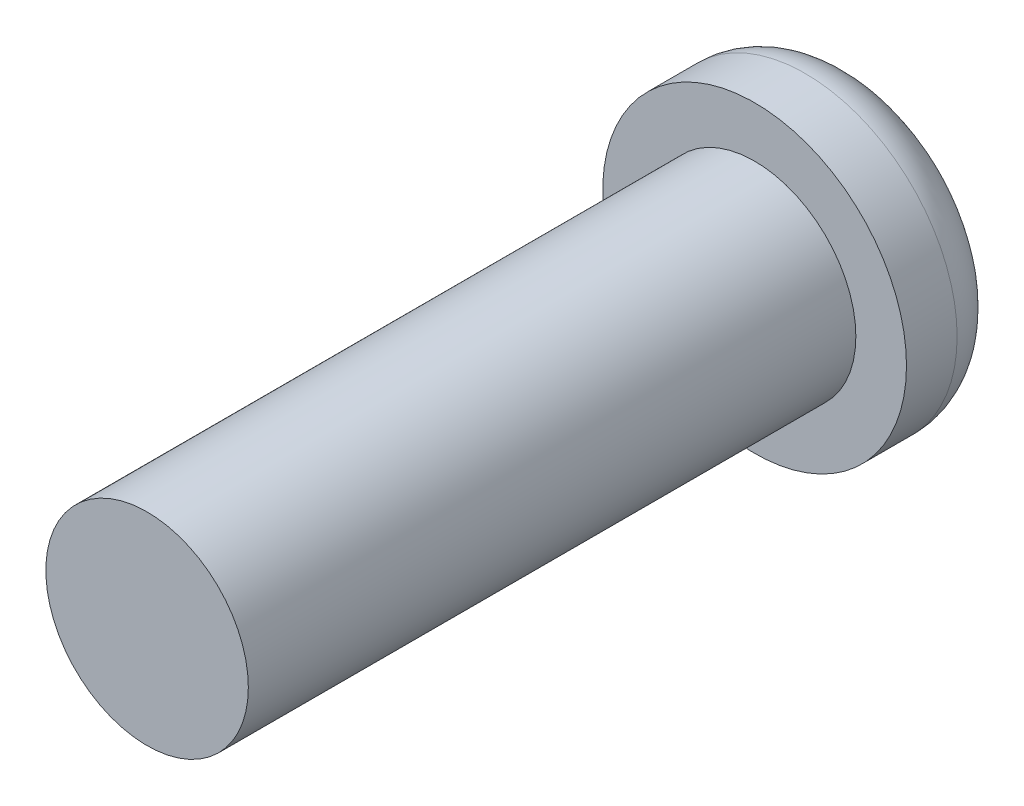
ISO-10303-21;
HEADER;
FILE_DESCRIPTION(('STEP AP214'),'2;1');
FILE_NAME('part.step','',(''),(''),'','','');
FILE_SCHEMA(('AUTOMOTIVE_DESIGN { 1 0 10303 214 1 1 1 1 }'));
ENDSEC;
DATA;
#1=APPLICATION_CONTEXT('core data for automotive mechanical design processes');
#2=APPLICATION_PROTOCOL_DEFINITION('international standard','automotive_design',2000,#1);
#3=PRODUCT_CONTEXT('',#1,'mechanical');
#4=PRODUCT('Part','Part','',(#3));
#5=PRODUCT_RELATED_PRODUCT_CATEGORY('part','',(#4));
#6=PRODUCT_DEFINITION_FORMATION('','',#4);
#7=PRODUCT_DEFINITION_CONTEXT('part definition',#1,'design');
#8=PRODUCT_DEFINITION('design','',#6,#7);
#9=PRODUCT_DEFINITION_SHAPE('','',#8);
#10=(LENGTH_UNIT() NAMED_UNIT(*) SI_UNIT(.MILLI.,.METRE.));
#11=(NAMED_UNIT(*) PLANE_ANGLE_UNIT() SI_UNIT($,.RADIAN.));
#12=(NAMED_UNIT(*) SI_UNIT($,.STERADIAN.) SOLID_ANGLE_UNIT());
#13=UNCERTAINTY_MEASURE_WITH_UNIT(LENGTH_MEASURE(1.E-05),#10,'distance_accuracy_value','');
#14=(GEOMETRIC_REPRESENTATION_CONTEXT(3) GLOBAL_UNCERTAINTY_ASSIGNED_CONTEXT((#13)) GLOBAL_UNIT_ASSIGNED_CONTEXT((#10,
#11,#12)) REPRESENTATION_CONTEXT('',''));
#15=CARTESIAN_POINT('',(0.,0.,0.));
#16=DIRECTION('',(0.,0.,1.));
#17=DIRECTION('',(1.,0.,0.));
#18=AXIS2_PLACEMENT_3D('',#15,#16,#17);
#19=CARTESIAN_POINT('',(0.,0.,1.));
#20=DIRECTION('',(0.,0.,-1.));
#21=DIRECTION('',(-1.,0.,0.));
#22=AXIS2_PLACEMENT_3D('',#19,#20,#21);
#23=CYLINDRICAL_SURFACE('',#22,1.5);
#24=CARTESIAN_POINT('',(0.,0.,0.5));
#25=DIRECTION('',(0.,0.,1.));
#26=DIRECTION('',(1.,0.,0.));
#27=AXIS2_PLACEMENT_3D('',#24,#25,#26);
#28=CIRCLE('',#27,1.5);
#29=CARTESIAN_POINT('',(1.5,0.,0.5));
#30=VERTEX_POINT('',#29);
#31=EDGE_CURVE('E42',#30,#30,#28,.T.);
#32=ORIENTED_EDGE('',*,*,#31,.T.);
#33=EDGE_LOOP('',(#32));
#34=FACE_BOUND('',#33,.T.);
#35=CARTESIAN_POINT('',(0.,0.,1.));
#36=DIRECTION('',(0.,0.,1.));
#37=DIRECTION('',(1.,0.,0.));
#38=AXIS2_PLACEMENT_3D('',#35,#36,#37);
#39=CIRCLE('',#38,1.5);
#40=CARTESIAN_POINT('',(1.5,0.,1.));
#41=VERTEX_POINT('',#40);
#42=EDGE_CURVE('E144',#41,#41,#39,.T.);
#43=ORIENTED_EDGE('',*,*,#42,.F.);
#44=EDGE_LOOP('',(#43));
#45=FACE_BOUND('',#44,.T.);
#46=ADVANCED_FACE('F34',(#34,#45),#23,.T.);
#47=CARTESIAN_POINT('',(0.,0.,1.));
#48=DIRECTION('',(0.,0.,1.));
#49=DIRECTION('',(1.,0.,0.));
#50=AXIS2_PLACEMENT_3D('',#47,#48,#49);
#51=PLANE('',#50);
#52=CARTESIAN_POINT('',(0.,0.,1.));
#53=DIRECTION('',(0.,0.,1.));
#54=DIRECTION('',(1.,0.,0.));
#55=AXIS2_PLACEMENT_3D('',#52,#53,#54);
#56=CIRCLE('',#55,1.);
#57=CARTESIAN_POINT('',(1.,0.,1.));
#58=VERTEX_POINT('',#57);
#59=EDGE_CURVE('E145',#58,#58,#56,.T.);
#60=ORIENTED_EDGE('',*,*,#59,.F.);
#61=EDGE_LOOP('',(#60));
#62=FACE_BOUND('',#61,.T.);
#63=ORIENTED_EDGE('',*,*,#42,.T.);
#64=EDGE_LOOP('',(#63));
#65=FACE_BOUND('',#64,.T.);
#66=ADVANCED_FACE('F163',(#62,#65),#51,.T.);
#67=CARTESIAN_POINT('',(0.,0.,0.));
#68=DIRECTION('',(0.,0.,1.));
#69=DIRECTION('',(1.,0.,0.));
#70=AXIS2_PLACEMENT_3D('',#67,#68,#69);
#71=PLANE('',#70);
#72=CARTESIAN_POINT('',(0.,0.,0.));
#73=DIRECTION('',(0.,0.,1.));
#74=DIRECTION('',(1.,0.,0.));
#75=AXIS2_PLACEMENT_3D('',#72,#73,#74);
#76=CIRCLE('',#75,1.);
#77=CARTESIAN_POINT('',(1.,0.,0.));
#78=VERTEX_POINT('',#77);
#79=EDGE_CURVE('E11',#78,#78,#76,.F.);
#80=ORIENTED_EDGE('',*,*,#79,.T.);
#81=EDGE_LOOP('',(#80));
#82=FACE_BOUND('',#81,.T.);
#83=DIRECTION('',(-0.545655910212218,0.838009324321917,0.));
#84=VECTOR('',#83,1.);
#85=CARTESIAN_POINT('',(-0.261487368837991,-0.514740409596448,0.));
#86=LINE('',#85,#84);
#87=CARTESIAN_POINT('',(-0.261487368837991,-0.514740409596448,0.));
#88=VERTEX_POINT('',#87);
#89=CARTESIAN_POINT('',(-0.576521955483926,-0.0309155006157711,0.));
#90=VERTEX_POINT('',#89);
#91=EDGE_CURVE('E123',#88,#90,#86,.T.);
#92=ORIENTED_EDGE('',*,*,#91,.F.);
#93=DIRECTION('',(-0.998565318577122,-0.0535472178079432,0.));
#94=VECTOR('',#93,1.);
#95=CARTESIAN_POINT('',(0.315034586645935,-0.483824908980676,0.));
#96=LINE('',#95,#94);
#97=CARTESIAN_POINT('',(0.315034586645935,-0.483824908980676,0.));
#98=VERTEX_POINT('',#97);
#99=EDGE_CURVE('E49',#98,#88,#96,.T.);
#100=ORIENTED_EDGE('',*,*,#99,.F.);
#101=DIRECTION('',(-0.452909408364904,-0.89155654212986,0.));
#102=VECTOR('',#101,1.);
#103=CARTESIAN_POINT('',(0.576521955483927,0.0309155006157713,0.));
#104=LINE('',#103,#102);
#105=CARTESIAN_POINT('',(0.576521955483927,0.0309155006157713,0.));
#106=VERTEX_POINT('',#105);
#107=EDGE_CURVE('E132',#106,#98,#104,.T.);
#108=ORIENTED_EDGE('',*,*,#107,.F.);
#109=DIRECTION('',(0.545655910212218,-0.838009324321917,0.));
#110=VECTOR('',#109,1.);
#111=CARTESIAN_POINT('',(0.261487368837991,0.514740409596448,0.));
#112=LINE('',#111,#110);
#113=CARTESIAN_POINT('',(0.261487368837991,0.514740409596448,0.));
#114=VERTEX_POINT('',#113);
#115=EDGE_CURVE('E130',#114,#106,#112,.T.);
#116=ORIENTED_EDGE('',*,*,#115,.F.);
#117=DIRECTION('',(0.998565318577122,0.0535472178079433,0.));
#118=VECTOR('',#117,1.);
#119=CARTESIAN_POINT('',(-0.315034586645934,0.483824908980677,0.));
#120=LINE('',#119,#118);
#121=CARTESIAN_POINT('',(-0.315034586645934,0.483824908980677,0.));
#122=VERTEX_POINT('',#121);
#123=EDGE_CURVE('E97',#122,#114,#120,.T.);
#124=ORIENTED_EDGE('',*,*,#123,.F.);
#125=DIRECTION('',(0.452909408364904,0.89155654212986,0.));
#126=VECTOR('',#125,1.);
#127=CARTESIAN_POINT('',(-0.576521955483926,-0.0309155006157711,0.));
#128=LINE('',#127,#126);
#129=EDGE_CURVE('E126',#90,#122,#128,.T.);
#130=ORIENTED_EDGE('',*,*,#129,.F.);
#131=EDGE_LOOP('',(#92,#100,#108,#116,#124,#130));
#132=FACE_BOUND('',#131,.T.);
#133=ADVANCED_FACE('F167',(#82,#132),#71,.F.);
#134=CARTESIAN_POINT('',(0.,0.,7.));
#135=DIRECTION('',(0.,0.,-1.));
#136=DIRECTION('',(-1.,0.,0.));
#137=AXIS2_PLACEMENT_3D('',#134,#135,#136);
#138=CYLINDRICAL_SURFACE('',#137,1.);
#139=CARTESIAN_POINT('',(0.,0.,7.));
#140=DIRECTION('',(0.,0.,1.));
#141=DIRECTION('',(1.,0.,0.));
#142=AXIS2_PLACEMENT_3D('',#139,#140,#141);
#143=CIRCLE('',#142,1.);
#144=CARTESIAN_POINT('',(1.,0.,7.));
#145=VERTEX_POINT('',#144);
#146=EDGE_CURVE('E136',#145,#145,#143,.T.);
#147=ORIENTED_EDGE('',*,*,#146,.F.);
#148=EDGE_LOOP('',(#147));
#149=FACE_BOUND('',#148,.T.);
#150=ORIENTED_EDGE('',*,*,#59,.T.);
#151=EDGE_LOOP('',(#150));
#152=FACE_BOUND('',#151,.T.);
#153=ADVANCED_FACE('F172',(#149,#152),#138,.T.);
#154=CARTESIAN_POINT('',(0.,0.,7.));
#155=DIRECTION('',(0.,0.,1.));
#156=DIRECTION('',(1.,0.,0.));
#157=AXIS2_PLACEMENT_3D('',#154,#155,#156);
#158=PLANE('',#157);
#159=ORIENTED_EDGE('',*,*,#146,.T.);
#160=EDGE_LOOP('',(#159));
#161=FACE_BOUND('',#160,.T.);
#162=ADVANCED_FACE('F177',(#161),#158,.T.);
#163=CARTESIAN_POINT('',(0.315034586645935,-0.483824908980676,0.75));
#164=DIRECTION('',(0.0535472178079432,-0.998565318577122,0.));
#165=DIRECTION('',(0.998565318577122,0.0535472178079432,0.));
#166=AXIS2_PLACEMENT_3D('',#163,#164,#165);
#167=PLANE('',#166);
#168=ORIENTED_EDGE('',*,*,#99,.T.);
#169=DIRECTION('',(0.,0.,-1.));
#170=VECTOR('',#169,1.);
#171=CARTESIAN_POINT('',(-0.261487368837991,-0.514740409596448,0.75));
#172=LINE('',#171,#170);
#173=CARTESIAN_POINT('',(-0.261487368837991,-0.514740409596448,0.75));
#174=VERTEX_POINT('',#173);
#175=EDGE_CURVE('E79',#174,#88,#172,.T.);
#176=ORIENTED_EDGE('',*,*,#175,.F.);
#177=DIRECTION('',(-0.998565318577122,-0.0535472178079432,0.));
#178=VECTOR('',#177,1.);
#179=CARTESIAN_POINT('',(0.315034586645935,-0.483824908980676,0.75));
#180=LINE('',#179,#178);
#181=CARTESIAN_POINT('',(0.315034586645935,-0.483824908980676,0.75));
#182=VERTEX_POINT('',#181);
#183=EDGE_CURVE('E134',#182,#174,#180,.T.);
#184=ORIENTED_EDGE('',*,*,#183,.F.);
#185=DIRECTION('',(0.,0.,-1.));
#186=VECTOR('',#185,1.);
#187=CARTESIAN_POINT('',(0.315034586645935,-0.483824908980676,0.75));
#188=LINE('',#187,#186);
#189=EDGE_CURVE('E57',#182,#98,#188,.T.);
#190=ORIENTED_EDGE('',*,*,#189,.T.);
#191=EDGE_LOOP('',(#168,#176,#184,#190));
#192=FACE_BOUND('',#191,.T.);
#193=ADVANCED_FACE('F181',(#192),#167,.F.);
#194=CARTESIAN_POINT('',(0.576521955483927,0.0309155006157713,0.75));
#195=DIRECTION('',(0.89155654212986,-0.452909408364904,0.));
#196=DIRECTION('',(0.452909408364904,0.89155654212986,0.));
#197=AXIS2_PLACEMENT_3D('',#194,#195,#196);
#198=PLANE('',#197);
#199=ORIENTED_EDGE('',*,*,#107,.T.);
#200=ORIENTED_EDGE('',*,*,#189,.F.);
#201=DIRECTION('',(-0.452909408364904,-0.89155654212986,0.));
#202=VECTOR('',#201,1.);
#203=CARTESIAN_POINT('',(0.576521955483927,0.0309155006157713,0.75));
#204=LINE('',#203,#202);
#205=CARTESIAN_POINT('',(0.576521955483927,0.0309155006157713,0.75));
#206=VERTEX_POINT('',#205);
#207=EDGE_CURVE('E109',#206,#182,#204,.T.);
#208=ORIENTED_EDGE('',*,*,#207,.F.);
#209=DIRECTION('',(0.,0.,-1.));
#210=VECTOR('',#209,1.);
#211=CARTESIAN_POINT('',(0.576521955483927,0.0309155006157713,0.75));
#212=LINE('',#211,#210);
#213=EDGE_CURVE('E101',#206,#106,#212,.T.);
#214=ORIENTED_EDGE('',*,*,#213,.T.);
#215=EDGE_LOOP('',(#199,#200,#208,#214));
#216=FACE_BOUND('',#215,.T.);
#217=ADVANCED_FACE('F185',(#216),#198,.F.);
#218=CARTESIAN_POINT('',(0.261487368837991,0.514740409596448,0.75));
#219=DIRECTION('',(0.838009324321917,0.545655910212218,0.));
#220=DIRECTION('',(-0.545655910212218,0.838009324321917,0.));
#221=AXIS2_PLACEMENT_3D('',#218,#219,#220);
#222=PLANE('',#221);
#223=ORIENTED_EDGE('',*,*,#115,.T.);
#224=ORIENTED_EDGE('',*,*,#213,.F.);
#225=DIRECTION('',(0.545655910212218,-0.838009324321917,0.));
#226=VECTOR('',#225,1.);
#227=CARTESIAN_POINT('',(0.261487368837991,0.514740409596448,0.75));
#228=LINE('',#227,#226);
#229=CARTESIAN_POINT('',(0.261487368837991,0.514740409596448,0.75));
#230=VERTEX_POINT('',#229);
#231=EDGE_CURVE('E105',#230,#206,#228,.T.);
#232=ORIENTED_EDGE('',*,*,#231,.F.);
#233=DIRECTION('',(0.,0.,-1.));
#234=VECTOR('',#233,1.);
#235=CARTESIAN_POINT('',(0.261487368837991,0.514740409596448,0.75));
#236=LINE('',#235,#234);
#237=EDGE_CURVE('E90',#230,#114,#236,.T.);
#238=ORIENTED_EDGE('',*,*,#237,.T.);
#239=EDGE_LOOP('',(#223,#224,#232,#238));
#240=FACE_BOUND('',#239,.T.);
#241=ADVANCED_FACE('F106',(#240),#222,.F.);
#242=CARTESIAN_POINT('',(-0.315034586645934,0.483824908980677,0.75));
#243=DIRECTION('',(-0.0535472178079433,0.998565318577122,0.));
#244=DIRECTION('',(-0.998565318577122,-0.0535472178079433,0.));
#245=AXIS2_PLACEMENT_3D('',#242,#243,#244);
#246=PLANE('',#245);
#247=ORIENTED_EDGE('',*,*,#123,.T.);
#248=ORIENTED_EDGE('',*,*,#237,.F.);
#249=DIRECTION('',(0.998565318577122,0.0535472178079433,0.));
#250=VECTOR('',#249,1.);
#251=CARTESIAN_POINT('',(-0.315034586645934,0.483824908980677,0.75));
#252=LINE('',#251,#250);
#253=CARTESIAN_POINT('',(-0.315034586645934,0.483824908980677,0.75));
#254=VERTEX_POINT('',#253);
#255=EDGE_CURVE('E94',#254,#230,#252,.T.);
#256=ORIENTED_EDGE('',*,*,#255,.F.);
#257=DIRECTION('',(0.,0.,-1.));
#258=VECTOR('',#257,1.);
#259=CARTESIAN_POINT('',(-0.315034586645934,0.483824908980677,0.75));
#260=LINE('',#259,#258);
#261=EDGE_CURVE('E102',#254,#122,#260,.T.);
#262=ORIENTED_EDGE('',*,*,#261,.T.);
#263=EDGE_LOOP('',(#247,#248,#256,#262));
#264=FACE_BOUND('',#263,.T.);
#265=ADVANCED_FACE('F92',(#264),#246,.F.);
#266=CARTESIAN_POINT('',(-0.576521955483926,-0.0309155006157711,0.75));
#267=DIRECTION('',(-0.89155654212986,0.452909408364904,0.));
#268=DIRECTION('',(-0.452909408364904,-0.89155654212986,0.));
#269=AXIS2_PLACEMENT_3D('',#266,#267,#268);
#270=PLANE('',#269);
#271=ORIENTED_EDGE('',*,*,#129,.T.);
#272=ORIENTED_EDGE('',*,*,#261,.F.);
#273=DIRECTION('',(0.452909408364904,0.89155654212986,0.));
#274=VECTOR('',#273,1.);
#275=CARTESIAN_POINT('',(-0.576521955483926,-0.0309155006157711,0.75));
#276=LINE('',#275,#274);
#277=CARTESIAN_POINT('',(-0.576521955483926,-0.0309155006157711,0.75));
#278=VERTEX_POINT('',#277);
#279=EDGE_CURVE('E115',#278,#254,#276,.T.);
#280=ORIENTED_EDGE('',*,*,#279,.F.);
#281=DIRECTION('',(0.,0.,-1.));
#282=VECTOR('',#281,1.);
#283=CARTESIAN_POINT('',(-0.576521955483926,-0.0309155006157711,0.75));
#284=LINE('',#283,#282);
#285=EDGE_CURVE('E139',#278,#90,#284,.T.);
#286=ORIENTED_EDGE('',*,*,#285,.T.);
#287=EDGE_LOOP('',(#271,#272,#280,#286));
#288=FACE_BOUND('',#287,.T.);
#289=ADVANCED_FACE('F188',(#288),#270,.F.);
#290=CARTESIAN_POINT('',(-0.261487368837991,-0.514740409596448,0.75));
#291=DIRECTION('',(-0.838009324321917,-0.545655910212218,0.));
#292=DIRECTION('',(0.545655910212218,-0.838009324321917,0.));
#293=AXIS2_PLACEMENT_3D('',#290,#291,#292);
#294=PLANE('',#293);
#295=ORIENTED_EDGE('',*,*,#91,.T.);
#296=ORIENTED_EDGE('',*,*,#285,.F.);
#297=DIRECTION('',(-0.545655910212218,0.838009324321917,0.));
#298=VECTOR('',#297,1.);
#299=CARTESIAN_POINT('',(-0.261487368837991,-0.514740409596448,0.75));
#300=LINE('',#299,#298);
#301=EDGE_CURVE('E117',#174,#278,#300,.T.);
#302=ORIENTED_EDGE('',*,*,#301,.F.);
#303=ORIENTED_EDGE('',*,*,#175,.T.);
#304=EDGE_LOOP('',(#295,#296,#302,#303));
#305=FACE_BOUND('',#304,.T.);
#306=ADVANCED_FACE('F159',(#305),#294,.F.);
#307=CARTESIAN_POINT('',(0.,0.,0.75));
#308=DIRECTION('',(0.,0.,-1.));
#309=DIRECTION('',(-1.,0.,0.));
#310=AXIS2_PLACEMENT_3D('',#307,#308,#309);
#311=PLANE('',#310);
#312=ORIENTED_EDGE('',*,*,#183,.T.);
#313=ORIENTED_EDGE('',*,*,#301,.T.);
#314=ORIENTED_EDGE('',*,*,#279,.T.);
#315=ORIENTED_EDGE('',*,*,#255,.T.);
#316=ORIENTED_EDGE('',*,*,#231,.T.);
#317=ORIENTED_EDGE('',*,*,#207,.T.);
#318=EDGE_LOOP('',(#312,#313,#314,#315,#316,#317));
#319=FACE_BOUND('',#318,.T.);
#320=ADVANCED_FACE('F112',(#319),#311,.T.);
#321=CARTESIAN_POINT('',(0.,0.,0.5));
#322=DIRECTION('',(0.,0.,1.));
#323=DIRECTION('',(1.,0.,0.));
#324=AXIS2_PLACEMENT_3D('',#321,#322,#323);
#325=TOROIDAL_SURFACE('',#324,1.,0.5);
#326=ORIENTED_EDGE('',*,*,#79,.F.);
#327=EDGE_LOOP('',(#326));
#328=FACE_BOUND('',#327,.T.);
#329=ORIENTED_EDGE('',*,*,#31,.F.);
#330=EDGE_LOOP('',(#329));
#331=FACE_BOUND('',#330,.T.);
#332=ADVANCED_FACE('F36',(#328,#331),#325,.T.);
#333=CLOSED_SHELL('',(#46,#66,#133,#153,#162,#193,#217,#241,#265,#289,#306,#320,#332));
#334=MANIFOLD_SOLID_BREP('B2',#333);
#335=ADVANCED_BREP_SHAPE_REPRESENTATION('',(#18,#334),#14);
#336=SHAPE_DEFINITION_REPRESENTATION(#9,#335);
ENDSEC;
END-ISO-10303-21;
